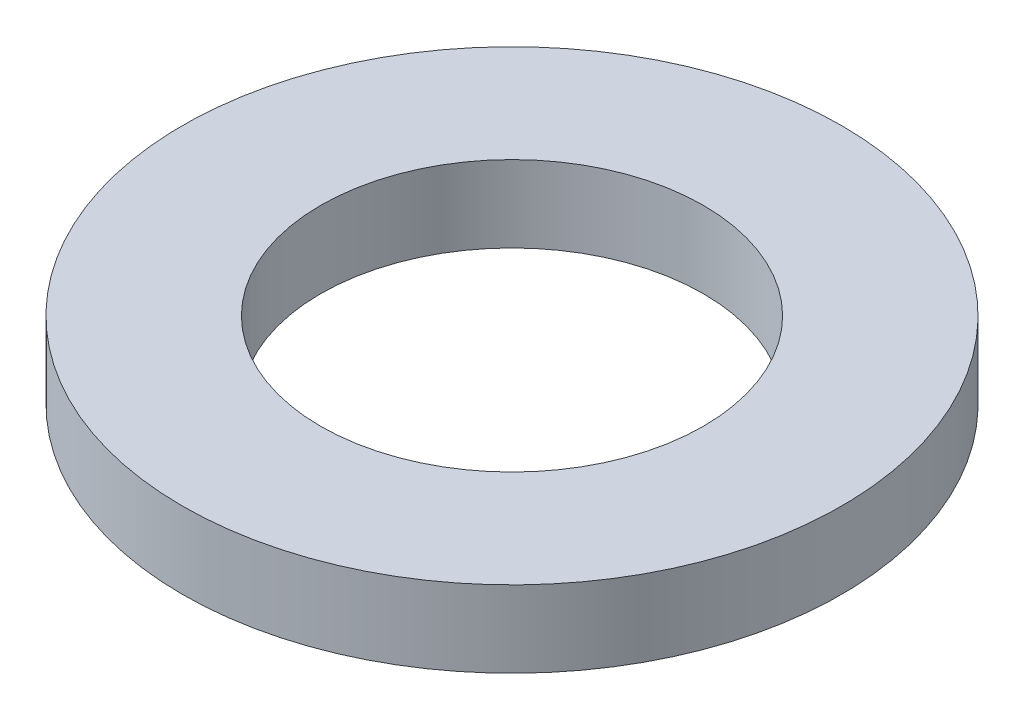
ISO-10303-21;
HEADER;
FILE_DESCRIPTION(('STEP AP214'),'2;1');
FILE_NAME('part.step','',(''),(''),'','','');
FILE_SCHEMA(('AUTOMOTIVE_DESIGN { 1 0 10303 214 1 1 1 1 }'));
ENDSEC;
DATA;
#1=APPLICATION_CONTEXT('core data for automotive mechanical design processes');
#2=APPLICATION_PROTOCOL_DEFINITION('international standard','automotive_design',2000,#1);
#3=PRODUCT_CONTEXT('',#1,'mechanical');
#4=PRODUCT('Part','Part','',(#3));
#5=PRODUCT_RELATED_PRODUCT_CATEGORY('part','',(#4));
#6=PRODUCT_DEFINITION_FORMATION('','',#4);
#7=PRODUCT_DEFINITION_CONTEXT('part definition',#1,'design');
#8=PRODUCT_DEFINITION('design','',#6,#7);
#9=PRODUCT_DEFINITION_SHAPE('','',#8);
#10=(LENGTH_UNIT() NAMED_UNIT(*) SI_UNIT(.MILLI.,.METRE.));
#11=(NAMED_UNIT(*) PLANE_ANGLE_UNIT() SI_UNIT($,.RADIAN.));
#12=(NAMED_UNIT(*) SI_UNIT($,.STERADIAN.) SOLID_ANGLE_UNIT());
#13=UNCERTAINTY_MEASURE_WITH_UNIT(LENGTH_MEASURE(1.E-05),#10,'distance_accuracy_value','');
#14=(GEOMETRIC_REPRESENTATION_CONTEXT(3) GLOBAL_UNCERTAINTY_ASSIGNED_CONTEXT((#13)) GLOBAL_UNIT_ASSIGNED_CONTEXT((#10,
#11,#12)) REPRESENTATION_CONTEXT('',''));
#15=CARTESIAN_POINT('',(0.,0.,0.));
#16=DIRECTION('',(0.,0.,1.));
#17=DIRECTION('',(1.,0.,0.));
#18=AXIS2_PLACEMENT_3D('',#15,#16,#17);
#19=CARTESIAN_POINT('',(0.,18.,0.));
#20=DIRECTION('',(0.,-1.,0.));
#21=DIRECTION('',(0.,0.,-1.));
#22=AXIS2_PLACEMENT_3D('',#19,#20,#21);
#23=CYLINDRICAL_SURFACE('',#22,77.5);
#24=CARTESIAN_POINT('',(0.,18.,0.));
#25=DIRECTION('',(0.,1.,0.));
#26=DIRECTION('',(0.,0.,1.));
#27=AXIS2_PLACEMENT_3D('',#24,#25,#26);
#28=CIRCLE('',#27,77.5);
#29=CARTESIAN_POINT('',(0.,18.,77.5));
#30=VERTEX_POINT('',#29);
#31=EDGE_CURVE('E10',#30,#30,#28,.T.);
#32=ORIENTED_EDGE('',*,*,#31,.F.);
#33=EDGE_LOOP('',(#32));
#34=FACE_BOUND('',#33,.T.);
#35=CARTESIAN_POINT('',(0.,0.,0.));
#36=DIRECTION('',(0.,1.,0.));
#37=DIRECTION('',(0.,0.,1.));
#38=AXIS2_PLACEMENT_3D('',#35,#36,#37);
#39=CIRCLE('',#38,77.5);
#40=CARTESIAN_POINT('',(0.,0.,77.5));
#41=VERTEX_POINT('',#40);
#42=EDGE_CURVE('E37',#41,#41,#39,.T.);
#43=ORIENTED_EDGE('',*,*,#42,.T.);
#44=EDGE_LOOP('',(#43));
#45=FACE_BOUND('',#44,.T.);
#46=ADVANCED_FACE('F40',(#34,#45),#23,.T.);
#47=CARTESIAN_POINT('',(0.,18.,0.));
#48=DIRECTION('',(0.,1.,0.));
#49=DIRECTION('',(0.,0.,1.));
#50=AXIS2_PLACEMENT_3D('',#47,#48,#49);
#51=PLANE('',#50);
#52=CARTESIAN_POINT('',(0.,18.,0.));
#53=DIRECTION('',(0.,1.,0.));
#54=DIRECTION('',(0.,0.,1.));
#55=AXIS2_PLACEMENT_3D('',#52,#53,#54);
#56=CIRCLE('',#55,45.);
#57=CARTESIAN_POINT('',(0.,18.,45.));
#58=VERTEX_POINT('',#57);
#59=EDGE_CURVE('E50',#58,#58,#56,.T.);
#60=ORIENTED_EDGE('',*,*,#59,.F.);
#61=EDGE_LOOP('',(#60));
#62=FACE_BOUND('',#61,.T.);
#63=ORIENTED_EDGE('',*,*,#31,.T.);
#64=EDGE_LOOP('',(#63));
#65=FACE_BOUND('',#64,.T.);
#66=ADVANCED_FACE('F59',(#62,#65),#51,.T.);
#67=CARTESIAN_POINT('',(0.,0.,0.));
#68=DIRECTION('',(0.,1.,0.));
#69=DIRECTION('',(0.,0.,1.));
#70=AXIS2_PLACEMENT_3D('',#67,#68,#69);
#71=PLANE('',#70);
#72=CARTESIAN_POINT('',(0.,0.,0.));
#73=DIRECTION('',(0.,1.,0.));
#74=DIRECTION('',(0.,0.,1.));
#75=AXIS2_PLACEMENT_3D('',#72,#73,#74);
#76=CIRCLE('',#75,45.);
#77=CARTESIAN_POINT('',(0.,0.,45.));
#78=VERTEX_POINT('',#77);
#79=EDGE_CURVE('E47',#78,#78,#76,.T.);
#80=ORIENTED_EDGE('',*,*,#79,.T.);
#81=EDGE_LOOP('',(#80));
#82=FACE_BOUND('',#81,.T.);
#83=ORIENTED_EDGE('',*,*,#42,.F.);
#84=EDGE_LOOP('',(#83));
#85=FACE_BOUND('',#84,.T.);
#86=ADVANCED_FACE('F58',(#82,#85),#71,.F.);
#87=CARTESIAN_POINT('',(0.,18.,0.));
#88=DIRECTION('',(0.,-1.,0.));
#89=DIRECTION('',(0.,0.,-1.));
#90=AXIS2_PLACEMENT_3D('',#87,#88,#89);
#91=CYLINDRICAL_SURFACE('',#90,45.);
#92=ORIENTED_EDGE('',*,*,#59,.T.);
#93=EDGE_LOOP('',(#92));
#94=FACE_BOUND('',#93,.T.);
#95=ORIENTED_EDGE('',*,*,#79,.F.);
#96=EDGE_LOOP('',(#95));
#97=FACE_BOUND('',#96,.T.);
#98=ADVANCED_FACE('F54',(#94,#97),#91,.F.);
#99=CLOSED_SHELL('',(#46,#66,#86,#98));
#100=MANIFOLD_SOLID_BREP('B2',#99);
#101=ADVANCED_BREP_SHAPE_REPRESENTATION('',(#18,#100),#14);
#102=SHAPE_DEFINITION_REPRESENTATION(#9,#101);
ENDSEC;
END-ISO-10303-21;
